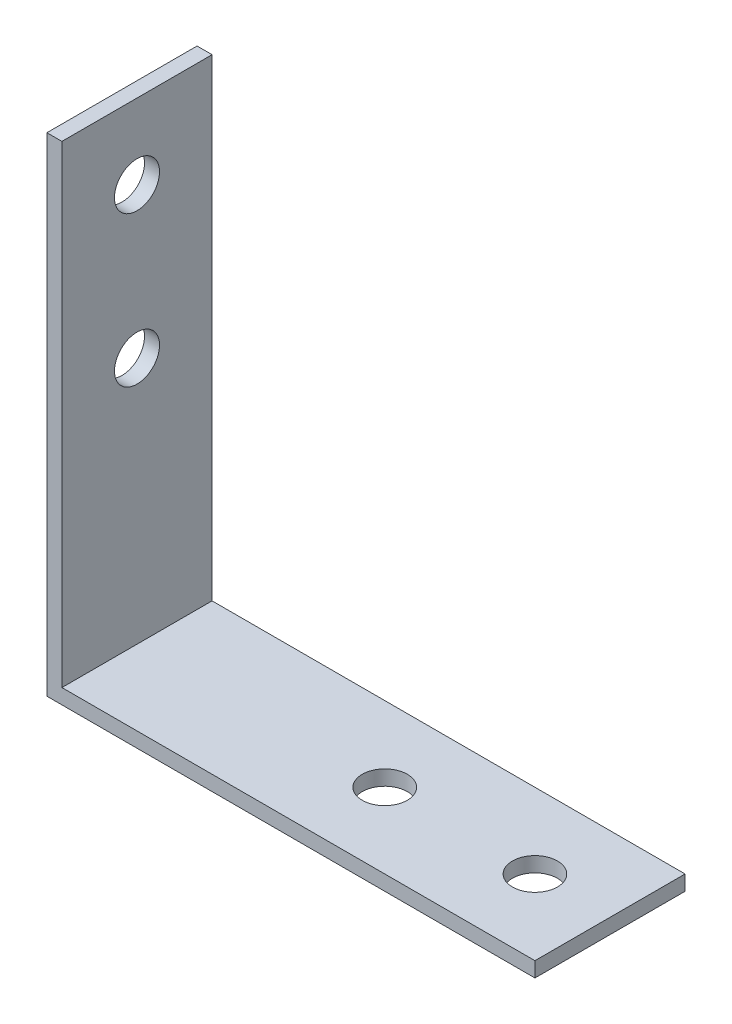
ISO-10303-21;
HEADER;
FILE_DESCRIPTION(('STEP AP214'),'2;1');
FILE_NAME('part.step','',(''),(''),'','','');
FILE_SCHEMA(('AUTOMOTIVE_DESIGN { 1 0 10303 214 1 1 1 1 }'));
ENDSEC;
DATA;
#1=APPLICATION_CONTEXT('core data for automotive mechanical design processes');
#2=APPLICATION_PROTOCOL_DEFINITION('international standard','automotive_design',2000,#1);
#3=PRODUCT_CONTEXT('',#1,'mechanical');
#4=PRODUCT('Part','Part','',(#3));
#5=PRODUCT_RELATED_PRODUCT_CATEGORY('part','',(#4));
#6=PRODUCT_DEFINITION_FORMATION('','',#4);
#7=PRODUCT_DEFINITION_CONTEXT('part definition',#1,'design');
#8=PRODUCT_DEFINITION('design','',#6,#7);
#9=PRODUCT_DEFINITION_SHAPE('','',#8);
#10=(LENGTH_UNIT() NAMED_UNIT(*) SI_UNIT(.MILLI.,.METRE.));
#11=(NAMED_UNIT(*) PLANE_ANGLE_UNIT() SI_UNIT($,.RADIAN.));
#12=(NAMED_UNIT(*) SI_UNIT($,.STERADIAN.) SOLID_ANGLE_UNIT());
#13=UNCERTAINTY_MEASURE_WITH_UNIT(LENGTH_MEASURE(1.E-05),#10,'distance_accuracy_value','');
#14=(GEOMETRIC_REPRESENTATION_CONTEXT(3) GLOBAL_UNCERTAINTY_ASSIGNED_CONTEXT((#13)) GLOBAL_UNIT_ASSIGNED_CONTEXT((#10,
#11,#12)) REPRESENTATION_CONTEXT('',''));
#15=CARTESIAN_POINT('',(0.,0.,0.));
#16=DIRECTION('',(0.,0.,1.));
#17=DIRECTION('',(1.,0.,0.));
#18=AXIS2_PLACEMENT_3D('',#15,#16,#17);
#19=CARTESIAN_POINT('',(0.,32.5,10.));
#20=DIRECTION('',(1.,0.,0.));
#21=DIRECTION('',(0.,1.,0.));
#22=AXIS2_PLACEMENT_3D('',#19,#20,#21);
#23=PLANE('',#22);
#24=CARTESIAN_POINT('',(0.,17.5,5.));
#25=DIRECTION('',(-1.,0.,0.));
#26=DIRECTION('',(0.,-1.,0.));
#27=AXIS2_PLACEMENT_3D('',#24,#25,#26);
#28=CIRCLE('',#27,1.5);
#29=CARTESIAN_POINT('',(0.,16.,5.));
#30=VERTEX_POINT('',#29);
#31=EDGE_CURVE('E141',#30,#30,#28,.T.);
#32=ORIENTED_EDGE('',*,*,#31,.F.);
#33=EDGE_LOOP('',(#32));
#34=FACE_BOUND('',#33,.T.);
#35=CARTESIAN_POINT('',(0.,27.5,5.));
#36=DIRECTION('',(-1.,0.,0.));
#37=DIRECTION('',(0.,-1.,0.));
#38=AXIS2_PLACEMENT_3D('',#35,#36,#37);
#39=CIRCLE('',#38,1.5);
#40=CARTESIAN_POINT('',(0.,26.,5.));
#41=VERTEX_POINT('',#40);
#42=EDGE_CURVE('E138',#41,#41,#39,.T.);
#43=ORIENTED_EDGE('',*,*,#42,.F.);
#44=EDGE_LOOP('',(#43));
#45=FACE_BOUND('',#44,.T.);
#46=DIRECTION('',(0.,-1.,0.));
#47=VECTOR('',#46,1.);
#48=CARTESIAN_POINT('',(0.,32.5,0.));
#49=LINE('',#48,#47);
#50=CARTESIAN_POINT('',(0.,32.5,0.));
#51=VERTEX_POINT('',#50);
#52=CARTESIAN_POINT('',(0.,0.,0.));
#53=VERTEX_POINT('',#52);
#54=EDGE_CURVE('E119',#51,#53,#49,.T.);
#55=ORIENTED_EDGE('',*,*,#54,.T.);
#56=DIRECTION('',(0.,0.,-1.));
#57=VECTOR('',#56,1.);
#58=CARTESIAN_POINT('',(0.,0.,10.));
#59=LINE('',#58,#57);
#60=CARTESIAN_POINT('',(0.,0.,10.));
#61=VERTEX_POINT('',#60);
#62=EDGE_CURVE('E11',#61,#53,#59,.T.);
#63=ORIENTED_EDGE('',*,*,#62,.F.);
#64=DIRECTION('',(0.,-1.,0.));
#65=VECTOR('',#64,1.);
#66=CARTESIAN_POINT('',(0.,32.5,10.));
#67=LINE('',#66,#65);
#68=CARTESIAN_POINT('',(0.,32.5,10.));
#69=VERTEX_POINT('',#68);
#70=EDGE_CURVE('E130',#69,#61,#67,.T.);
#71=ORIENTED_EDGE('',*,*,#70,.F.);
#72=DIRECTION('',(0.,0.,-1.));
#73=VECTOR('',#72,1.);
#74=CARTESIAN_POINT('',(0.,32.5,10.));
#75=LINE('',#74,#73);
#76=EDGE_CURVE('E115',#69,#51,#75,.T.);
#77=ORIENTED_EDGE('',*,*,#76,.T.);
#78=EDGE_LOOP('',(#55,#63,#71,#77));
#79=FACE_BOUND('',#78,.T.);
#80=ADVANCED_FACE('F33',(#34,#45,#79),#23,.F.);
#81=CARTESIAN_POINT('',(0.,0.,10.));
#82=DIRECTION('',(0.,1.,0.));
#83=DIRECTION('',(0.,0.,1.));
#84=AXIS2_PLACEMENT_3D('',#81,#82,#83);
#85=PLANE('',#84);
#86=CARTESIAN_POINT('',(17.5,0.,5.));
#87=DIRECTION('',(0.,-1.,0.));
#88=DIRECTION('',(0.,0.,-1.));
#89=AXIS2_PLACEMENT_3D('',#86,#87,#88);
#90=CIRCLE('',#89,1.5);
#91=CARTESIAN_POINT('',(17.5,0.,3.5));
#92=VERTEX_POINT('',#91);
#93=EDGE_CURVE('E154',#92,#92,#90,.T.);
#94=ORIENTED_EDGE('',*,*,#93,.F.);
#95=EDGE_LOOP('',(#94));
#96=FACE_BOUND('',#95,.T.);
#97=CARTESIAN_POINT('',(27.5,0.,5.));
#98=DIRECTION('',(0.,-1.,0.));
#99=DIRECTION('',(0.,0.,-1.));
#100=AXIS2_PLACEMENT_3D('',#97,#98,#99);
#101=CIRCLE('',#100,1.5);
#102=CARTESIAN_POINT('',(27.5,0.,3.5));
#103=VERTEX_POINT('',#102);
#104=EDGE_CURVE('E144',#103,#103,#101,.T.);
#105=ORIENTED_EDGE('',*,*,#104,.F.);
#106=EDGE_LOOP('',(#105));
#107=FACE_BOUND('',#106,.T.);
#108=DIRECTION('',(1.,0.,0.));
#109=VECTOR('',#108,1.);
#110=CARTESIAN_POINT('',(0.,0.,0.));
#111=LINE('',#110,#109);
#112=CARTESIAN_POINT('',(32.5,0.,0.));
#113=VERTEX_POINT('',#112);
#114=EDGE_CURVE('E122',#53,#113,#111,.T.);
#115=ORIENTED_EDGE('',*,*,#114,.T.);
#116=DIRECTION('',(0.,0.,-1.));
#117=VECTOR('',#116,1.);
#118=CARTESIAN_POINT('',(32.5,0.,10.));
#119=LINE('',#118,#117);
#120=CARTESIAN_POINT('',(32.5,0.,10.));
#121=VERTEX_POINT('',#120);
#122=EDGE_CURVE('E42',#121,#113,#119,.T.);
#123=ORIENTED_EDGE('',*,*,#122,.F.);
#124=DIRECTION('',(1.,0.,0.));
#125=VECTOR('',#124,1.);
#126=CARTESIAN_POINT('',(0.,0.,10.));
#127=LINE('',#126,#125);
#128=EDGE_CURVE('E88',#61,#121,#127,.T.);
#129=ORIENTED_EDGE('',*,*,#128,.F.);
#130=ORIENTED_EDGE('',*,*,#62,.T.);
#131=EDGE_LOOP('',(#115,#123,#129,#130));
#132=FACE_BOUND('',#131,.T.);
#133=ADVANCED_FACE('F162',(#96,#107,#132),#85,.F.);
#134=CARTESIAN_POINT('',(32.5,0.,10.));
#135=DIRECTION('',(-1.,0.,0.));
#136=DIRECTION('',(0.,0.,1.));
#137=AXIS2_PLACEMENT_3D('',#134,#135,#136);
#138=PLANE('',#137);
#139=DIRECTION('',(0.,1.,0.));
#140=VECTOR('',#139,1.);
#141=CARTESIAN_POINT('',(32.5,0.,0.));
#142=LINE('',#141,#140);
#143=CARTESIAN_POINT('',(32.5,1.,0.));
#144=VERTEX_POINT('',#143);
#145=EDGE_CURVE('E125',#113,#144,#142,.T.);
#146=ORIENTED_EDGE('',*,*,#145,.T.);
#147=DIRECTION('',(0.,0.,-1.));
#148=VECTOR('',#147,1.);
#149=CARTESIAN_POINT('',(32.5,1.,10.));
#150=LINE('',#149,#148);
#151=CARTESIAN_POINT('',(32.5,1.,10.));
#152=VERTEX_POINT('',#151);
#153=EDGE_CURVE('E110',#152,#144,#150,.T.);
#154=ORIENTED_EDGE('',*,*,#153,.F.);
#155=DIRECTION('',(0.,1.,0.));
#156=VECTOR('',#155,1.);
#157=CARTESIAN_POINT('',(32.5,0.,10.));
#158=LINE('',#157,#156);
#159=EDGE_CURVE('E101',#121,#152,#158,.T.);
#160=ORIENTED_EDGE('',*,*,#159,.F.);
#161=ORIENTED_EDGE('',*,*,#122,.T.);
#162=EDGE_LOOP('',(#146,#154,#160,#161));
#163=FACE_BOUND('',#162,.T.);
#164=ADVANCED_FACE('F165',(#163),#138,.F.);
#165=CARTESIAN_POINT('',(32.5,1.,10.));
#166=DIRECTION('',(0.,-1.,0.));
#167=DIRECTION('',(1.,0.,0.));
#168=AXIS2_PLACEMENT_3D('',#165,#166,#167);
#169=PLANE('',#168);
#170=CARTESIAN_POINT('',(17.5,1.,5.));
#171=DIRECTION('',(0.,-1.,0.));
#172=DIRECTION('',(1.,0.,0.));
#173=AXIS2_PLACEMENT_3D('',#170,#171,#172);
#174=CIRCLE('',#173,1.5);
#175=CARTESIAN_POINT('',(19.,1.,5.));
#176=VERTEX_POINT('',#175);
#177=EDGE_CURVE('E36',#176,#176,#174,.T.);
#178=ORIENTED_EDGE('',*,*,#177,.T.);
#179=EDGE_LOOP('',(#178));
#180=FACE_BOUND('',#179,.T.);
#181=CARTESIAN_POINT('',(27.5,1.,5.));
#182=DIRECTION('',(0.,-1.,0.));
#183=DIRECTION('',(1.,0.,0.));
#184=AXIS2_PLACEMENT_3D('',#181,#182,#183);
#185=CIRCLE('',#184,1.5);
#186=CARTESIAN_POINT('',(29.,1.,5.));
#187=VERTEX_POINT('',#186);
#188=EDGE_CURVE('E142',#187,#187,#185,.T.);
#189=ORIENTED_EDGE('',*,*,#188,.T.);
#190=EDGE_LOOP('',(#189));
#191=FACE_BOUND('',#190,.T.);
#192=DIRECTION('',(-1.,0.,0.));
#193=VECTOR('',#192,1.);
#194=CARTESIAN_POINT('',(32.5,1.,0.));
#195=LINE('',#194,#193);
#196=CARTESIAN_POINT('',(0.999999999999997,0.999999999999997,0.));
#197=VERTEX_POINT('',#196);
#198=EDGE_CURVE('E109',#144,#197,#195,.T.);
#199=ORIENTED_EDGE('',*,*,#198,.T.);
#200=DIRECTION('',(0.,0.,-1.));
#201=VECTOR('',#200,1.);
#202=CARTESIAN_POINT('',(0.999999999999997,0.999999999999997,10.));
#203=LINE('',#202,#201);
#204=CARTESIAN_POINT('',(0.999999999999997,0.999999999999997,10.));
#205=VERTEX_POINT('',#204);
#206=EDGE_CURVE('E106',#205,#197,#203,.T.);
#207=ORIENTED_EDGE('',*,*,#206,.F.);
#208=DIRECTION('',(-1.,0.,0.));
#209=VECTOR('',#208,1.);
#210=CARTESIAN_POINT('',(32.5,1.,10.));
#211=LINE('',#210,#209);
#212=EDGE_CURVE('E95',#152,#205,#211,.T.);
#213=ORIENTED_EDGE('',*,*,#212,.F.);
#214=ORIENTED_EDGE('',*,*,#153,.T.);
#215=EDGE_LOOP('',(#199,#207,#213,#214));
#216=FACE_BOUND('',#215,.T.);
#217=ADVANCED_FACE('F107',(#180,#191,#216),#169,.F.);
#218=CARTESIAN_POINT('',(0.999999999999997,0.999999999999997,10.));
#219=DIRECTION('',(-1.,0.,0.));
#220=DIRECTION('',(0.,-1.,0.));
#221=AXIS2_PLACEMENT_3D('',#218,#219,#220);
#222=PLANE('',#221);
#223=CARTESIAN_POINT('',(1.,17.5,5.));
#224=DIRECTION('',(-1.,0.,0.));
#225=DIRECTION('',(0.,-1.,0.));
#226=AXIS2_PLACEMENT_3D('',#223,#224,#225);
#227=CIRCLE('',#226,1.5);
#228=CARTESIAN_POINT('',(1.,16.,5.));
#229=VERTEX_POINT('',#228);
#230=EDGE_CURVE('E139',#229,#229,#227,.T.);
#231=ORIENTED_EDGE('',*,*,#230,.T.);
#232=EDGE_LOOP('',(#231));
#233=FACE_BOUND('',#232,.T.);
#234=CARTESIAN_POINT('',(1.,27.5,5.));
#235=DIRECTION('',(-1.,0.,0.));
#236=DIRECTION('',(0.,-1.,0.));
#237=AXIS2_PLACEMENT_3D('',#234,#235,#236);
#238=CIRCLE('',#237,1.5);
#239=CARTESIAN_POINT('',(1.,26.,5.));
#240=VERTEX_POINT('',#239);
#241=EDGE_CURVE('E123',#240,#240,#238,.T.);
#242=ORIENTED_EDGE('',*,*,#241,.T.);
#243=EDGE_LOOP('',(#242));
#244=FACE_BOUND('',#243,.T.);
#245=DIRECTION('',(0.,1.,0.));
#246=VECTOR('',#245,1.);
#247=CARTESIAN_POINT('',(0.999999999999997,0.999999999999997,0.));
#248=LINE('',#247,#246);
#249=CARTESIAN_POINT('',(0.999999999999999,32.5,0.));
#250=VERTEX_POINT('',#249);
#251=EDGE_CURVE('E74',#197,#250,#248,.T.);
#252=ORIENTED_EDGE('',*,*,#251,.T.);
#253=DIRECTION('',(0.,0.,-1.));
#254=VECTOR('',#253,1.);
#255=CARTESIAN_POINT('',(0.999999999999999,32.5,10.));
#256=LINE('',#255,#254);
#257=CARTESIAN_POINT('',(0.999999999999999,32.5,10.));
#258=VERTEX_POINT('',#257);
#259=EDGE_CURVE('E111',#258,#250,#256,.T.);
#260=ORIENTED_EDGE('',*,*,#259,.F.);
#261=DIRECTION('',(0.,1.,0.));
#262=VECTOR('',#261,1.);
#263=CARTESIAN_POINT('',(0.999999999999997,0.999999999999997,10.));
#264=LINE('',#263,#262);
#265=EDGE_CURVE('E99',#205,#258,#264,.T.);
#266=ORIENTED_EDGE('',*,*,#265,.F.);
#267=ORIENTED_EDGE('',*,*,#206,.T.);
#268=EDGE_LOOP('',(#252,#260,#266,#267));
#269=FACE_BOUND('',#268,.T.);
#270=ADVANCED_FACE('F113',(#233,#244,#269),#222,.F.);
#271=CARTESIAN_POINT('',(0.999999999999999,32.5,10.));
#272=DIRECTION('',(0.,-1.,0.));
#273=DIRECTION('',(0.,0.,-1.));
#274=AXIS2_PLACEMENT_3D('',#271,#272,#273);
#275=PLANE('',#274);
#276=DIRECTION('',(-1.,0.,0.));
#277=VECTOR('',#276,1.);
#278=CARTESIAN_POINT('',(0.999999999999999,32.5,0.));
#279=LINE('',#278,#277);
#280=EDGE_CURVE('E80',#250,#51,#279,.T.);
#281=ORIENTED_EDGE('',*,*,#280,.T.);
#282=ORIENTED_EDGE('',*,*,#76,.F.);
#283=DIRECTION('',(-1.,0.,0.));
#284=VECTOR('',#283,1.);
#285=CARTESIAN_POINT('',(0.999999999999999,32.5,10.));
#286=LINE('',#285,#284);
#287=EDGE_CURVE('E51',#258,#69,#286,.T.);
#288=ORIENTED_EDGE('',*,*,#287,.F.);
#289=ORIENTED_EDGE('',*,*,#259,.T.);
#290=EDGE_LOOP('',(#281,#282,#288,#289));
#291=FACE_BOUND('',#290,.T.);
#292=ADVANCED_FACE('F170',(#291),#275,.F.);
#293=CARTESIAN_POINT('',(0.,0.,10.));
#294=DIRECTION('',(0.,0.,1.));
#295=DIRECTION('',(1.,0.,0.));
#296=AXIS2_PLACEMENT_3D('',#293,#294,#295);
#297=PLANE('',#296);
#298=ORIENTED_EDGE('',*,*,#70,.T.);
#299=ORIENTED_EDGE('',*,*,#128,.T.);
#300=ORIENTED_EDGE('',*,*,#159,.T.);
#301=ORIENTED_EDGE('',*,*,#212,.T.);
#302=ORIENTED_EDGE('',*,*,#265,.T.);
#303=ORIENTED_EDGE('',*,*,#287,.T.);
#304=EDGE_LOOP('',(#298,#299,#300,#301,#302,#303));
#305=FACE_BOUND('',#304,.T.);
#306=ADVANCED_FACE('F97',(#305),#297,.T.);
#307=CARTESIAN_POINT('',(0.,0.,0.));
#308=DIRECTION('',(0.,0.,1.));
#309=DIRECTION('',(1.,0.,0.));
#310=AXIS2_PLACEMENT_3D('',#307,#308,#309);
#311=PLANE('',#310);
#312=ORIENTED_EDGE('',*,*,#54,.F.);
#313=ORIENTED_EDGE('',*,*,#280,.F.);
#314=ORIENTED_EDGE('',*,*,#251,.F.);
#315=ORIENTED_EDGE('',*,*,#198,.F.);
#316=ORIENTED_EDGE('',*,*,#145,.F.);
#317=ORIENTED_EDGE('',*,*,#114,.F.);
#318=EDGE_LOOP('',(#312,#313,#314,#315,#316,#317));
#319=FACE_BOUND('',#318,.T.);
#320=ADVANCED_FACE('F168',(#319),#311,.F.);
#321=CARTESIAN_POINT('',(32.5,27.5,5.));
#322=DIRECTION('',(-1.,0.,0.));
#323=DIRECTION('',(0.,-1.,0.));
#324=AXIS2_PLACEMENT_3D('',#321,#322,#323);
#325=CYLINDRICAL_SURFACE('',#324,1.5);
#326=ORIENTED_EDGE('',*,*,#42,.T.);
#327=EDGE_LOOP('',(#326));
#328=FACE_BOUND('',#327,.T.);
#329=ORIENTED_EDGE('',*,*,#241,.F.);
#330=EDGE_LOOP('',(#329));
#331=FACE_BOUND('',#330,.T.);
#332=ADVANCED_FACE('F191',(#328,#331),#325,.F.);
#333=CARTESIAN_POINT('',(32.5,17.5,5.));
#334=DIRECTION('',(-1.,0.,0.));
#335=DIRECTION('',(0.,-1.,0.));
#336=AXIS2_PLACEMENT_3D('',#333,#334,#335);
#337=CYLINDRICAL_SURFACE('',#336,1.5);
#338=ORIENTED_EDGE('',*,*,#31,.T.);
#339=EDGE_LOOP('',(#338));
#340=FACE_BOUND('',#339,.T.);
#341=ORIENTED_EDGE('',*,*,#230,.F.);
#342=EDGE_LOOP('',(#341));
#343=FACE_BOUND('',#342,.T.);
#344=ADVANCED_FACE('F194',(#340,#343),#337,.F.);
#345=CARTESIAN_POINT('',(27.5,32.5,5.));
#346=DIRECTION('',(0.,-1.,0.));
#347=DIRECTION('',(0.,0.,-1.));
#348=AXIS2_PLACEMENT_3D('',#345,#346,#347);
#349=CYLINDRICAL_SURFACE('',#348,1.5);
#350=ORIENTED_EDGE('',*,*,#104,.T.);
#351=EDGE_LOOP('',(#350));
#352=FACE_BOUND('',#351,.T.);
#353=ORIENTED_EDGE('',*,*,#188,.F.);
#354=EDGE_LOOP('',(#353));
#355=FACE_BOUND('',#354,.T.);
#356=ADVANCED_FACE('F202',(#352,#355),#349,.F.);
#357=CARTESIAN_POINT('',(17.5,32.5,5.));
#358=DIRECTION('',(0.,-1.,0.));
#359=DIRECTION('',(0.,0.,-1.));
#360=AXIS2_PLACEMENT_3D('',#357,#358,#359);
#361=CYLINDRICAL_SURFACE('',#360,1.5);
#362=ORIENTED_EDGE('',*,*,#93,.T.);
#363=EDGE_LOOP('',(#362));
#364=FACE_BOUND('',#363,.T.);
#365=ORIENTED_EDGE('',*,*,#177,.F.);
#366=EDGE_LOOP('',(#365));
#367=FACE_BOUND('',#366,.T.);
#368=ADVANCED_FACE('F208',(#364,#367),#361,.F.);
#369=CLOSED_SHELL('',(#80,#133,#164,#217,#270,#292,#306,#320,#332,#344,#356,#368));
#370=MANIFOLD_SOLID_BREP('B2',#369);
#371=ADVANCED_BREP_SHAPE_REPRESENTATION('',(#18,#370),#14);
#372=SHAPE_DEFINITION_REPRESENTATION(#9,#371);
ENDSEC;
END-ISO-10303-21;
